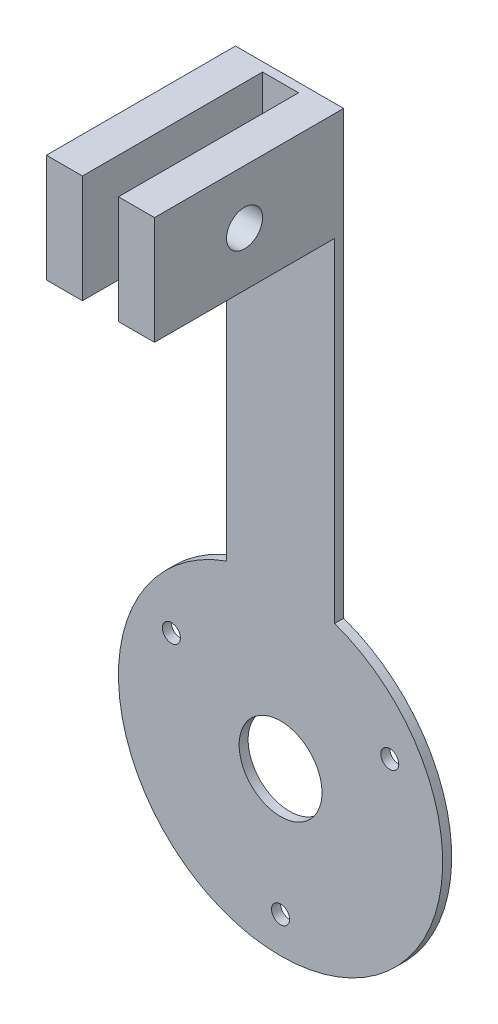
ISO-10303-21;
HEADER;
FILE_DESCRIPTION(('STEP AP214'),'2;1');
FILE_NAME('part.step','',(''),(''),'','','');
FILE_SCHEMA(('AUTOMOTIVE_DESIGN { 1 0 10303 214 1 1 1 1 }'));
ENDSEC;
DATA;
#1=APPLICATION_CONTEXT('core data for automotive mechanical design processes');
#2=APPLICATION_PROTOCOL_DEFINITION('international standard','automotive_design',2000,#1);
#3=PRODUCT_CONTEXT('',#1,'mechanical');
#4=PRODUCT('Part','Part','',(#3));
#5=PRODUCT_RELATED_PRODUCT_CATEGORY('part','',(#4));
#6=PRODUCT_DEFINITION_FORMATION('','',#4);
#7=PRODUCT_DEFINITION_CONTEXT('part definition',#1,'design');
#8=PRODUCT_DEFINITION('design','',#6,#7);
#9=PRODUCT_DEFINITION_SHAPE('','',#8);
#10=(LENGTH_UNIT() NAMED_UNIT(*) SI_UNIT(.MILLI.,.METRE.));
#11=(NAMED_UNIT(*) PLANE_ANGLE_UNIT() SI_UNIT($,.RADIAN.));
#12=(NAMED_UNIT(*) SI_UNIT($,.STERADIAN.) SOLID_ANGLE_UNIT());
#13=UNCERTAINTY_MEASURE_WITH_UNIT(LENGTH_MEASURE(1.E-05),#10,'distance_accuracy_value','');
#14=(GEOMETRIC_REPRESENTATION_CONTEXT(3) GLOBAL_UNCERTAINTY_ASSIGNED_CONTEXT((#13)) GLOBAL_UNIT_ASSIGNED_CONTEXT((#10,
#11,#12)) REPRESENTATION_CONTEXT('',''));
#15=CARTESIAN_POINT('',(0.,0.,0.));
#16=DIRECTION('',(0.,0.,1.));
#17=DIRECTION('',(1.,0.,0.));
#18=AXIS2_PLACEMENT_3D('',#15,#16,#17);
#19=CARTESIAN_POINT('',(0.,0.,3.175));
#20=DIRECTION('',(0.,0.,1.));
#21=DIRECTION('',(1.,0.,0.));
#22=AXIS2_PLACEMENT_3D('',#19,#20,#21);
#23=PLANE('',#22);
#24=CARTESIAN_POINT('',(0.,0.,3.175));
#25=DIRECTION('',(0.,0.,1.));
#26=DIRECTION('',(1.,0.,0.));
#27=AXIS2_PLACEMENT_3D('',#24,#25,#26);
#28=CIRCLE('',#27,57.15);
#29=CARTESIAN_POINT('',(-19.05,53.8815367264149,3.175));
#30=VERTEX_POINT('',#29);
#31=CARTESIAN_POINT('',(19.05,53.8815367264149,3.175));
#32=VERTEX_POINT('',#31);
#33=EDGE_CURVE('E132',#30,#32,#28,.T.);
#34=ORIENTED_EDGE('',*,*,#33,.T.);
#35=DIRECTION('',(0.,1.,0.));
#36=VECTOR('',#35,1.);
#37=CARTESIAN_POINT('',(19.05,0.,3.175));
#38=LINE('',#37,#36);
#39=CARTESIAN_POINT('',(19.05,171.45,3.175));
#40=VERTEX_POINT('',#39);
#41=EDGE_CURVE('E213',#32,#40,#38,.T.);
#42=ORIENTED_EDGE('',*,*,#41,.T.);
#43=DIRECTION('',(1.,0.,0.));
#44=VECTOR('',#43,1.);
#45=CARTESIAN_POINT('',(0.,171.45,3.175));
#46=LINE('',#45,#44);
#47=CARTESIAN_POINT('',(6.34999999999998,171.45,3.175));
#48=VERTEX_POINT('',#47);
#49=EDGE_CURVE('E156',#48,#40,#46,.T.);
#50=ORIENTED_EDGE('',*,*,#49,.F.);
#51=DIRECTION('',(0.,-1.,0.));
#52=VECTOR('',#51,1.);
#53=CARTESIAN_POINT('',(6.34999999999995,0.,3.175));
#54=LINE('',#53,#52);
#55=CARTESIAN_POINT('',(6.34999999999999,209.55,3.175));
#56=VERTEX_POINT('',#55);
#57=EDGE_CURVE('E151',#56,#48,#54,.T.);
#58=ORIENTED_EDGE('',*,*,#57,.F.);
#59=DIRECTION('',(1.,0.,0.));
#60=VECTOR('',#59,1.);
#61=CARTESIAN_POINT('',(0.,209.55,3.175));
#62=LINE('',#61,#60);
#63=CARTESIAN_POINT('',(-6.34999999999999,209.55,3.175));
#64=VERTEX_POINT('',#63);
#65=EDGE_CURVE('E52',#64,#56,#62,.T.);
#66=ORIENTED_EDGE('',*,*,#65,.F.);
#67=DIRECTION('',(0.,-1.,0.));
#68=VECTOR('',#67,1.);
#69=CARTESIAN_POINT('',(-6.34999999999995,0.,3.175));
#70=LINE('',#69,#68);
#71=CARTESIAN_POINT('',(-6.34999999999998,171.45,3.175));
#72=VERTEX_POINT('',#71);
#73=EDGE_CURVE('E173',#64,#72,#70,.T.);
#74=ORIENTED_EDGE('',*,*,#73,.T.);
#75=DIRECTION('',(1.,0.,0.));
#76=VECTOR('',#75,1.);
#77=CARTESIAN_POINT('',(0.,171.45,3.175));
#78=LINE('',#77,#76);
#79=CARTESIAN_POINT('',(-19.05,171.45,3.175));
#80=VERTEX_POINT('',#79);
#81=EDGE_CURVE('E58',#80,#72,#78,.T.);
#82=ORIENTED_EDGE('',*,*,#81,.F.);
#83=DIRECTION('',(0.,1.,0.));
#84=VECTOR('',#83,1.);
#85=CARTESIAN_POINT('',(-19.05,0.,3.175));
#86=LINE('',#85,#84);
#87=EDGE_CURVE('E211',#30,#80,#86,.T.);
#88=ORIENTED_EDGE('',*,*,#87,.F.);
#89=EDGE_LOOP('',(#34,#42,#50,#58,#66,#74,#82,#88));
#90=FACE_BOUND('',#89,.T.);
#91=CARTESIAN_POINT('',(-38.4948291982183,22.225,3.175));
#92=DIRECTION('',(0.,0.,1.));
#93=DIRECTION('',(1.,0.,0.));
#94=AXIS2_PLACEMENT_3D('',#91,#92,#93);
#95=CIRCLE('',#94,3.175);
#96=CARTESIAN_POINT('',(-35.3198291982183,22.225,3.175));
#97=VERTEX_POINT('',#96);
#98=EDGE_CURVE('E197',#97,#97,#95,.T.);
#99=ORIENTED_EDGE('',*,*,#98,.F.);
#100=EDGE_LOOP('',(#99));
#101=FACE_BOUND('',#100,.T.);
#102=CARTESIAN_POINT('',(38.4948291982183,22.225,3.175));
#103=DIRECTION('',(0.,0.,1.));
#104=DIRECTION('',(1.,0.,0.));
#105=AXIS2_PLACEMENT_3D('',#102,#103,#104);
#106=CIRCLE('',#105,3.175);
#107=CARTESIAN_POINT('',(41.6698291982183,22.225,3.175));
#108=VERTEX_POINT('',#107);
#109=EDGE_CURVE('E203',#108,#108,#106,.T.);
#110=ORIENTED_EDGE('',*,*,#109,.F.);
#111=EDGE_LOOP('',(#110));
#112=FACE_BOUND('',#111,.T.);
#113=CARTESIAN_POINT('',(0.,-44.45,3.175));
#114=DIRECTION('',(0.,0.,1.));
#115=DIRECTION('',(1.,0.,0.));
#116=AXIS2_PLACEMENT_3D('',#113,#114,#115);
#117=CIRCLE('',#116,3.175);
#118=CARTESIAN_POINT('',(3.175,-44.45,3.175));
#119=VERTEX_POINT('',#118);
#120=EDGE_CURVE('E194',#119,#119,#117,.T.);
#121=ORIENTED_EDGE('',*,*,#120,.F.);
#122=EDGE_LOOP('',(#121));
#123=FACE_BOUND('',#122,.T.);
#124=CARTESIAN_POINT('',(0.,0.,3.175));
#125=DIRECTION('',(0.,0.,1.));
#126=DIRECTION('',(1.,0.,0.));
#127=AXIS2_PLACEMENT_3D('',#124,#125,#126);
#128=CIRCLE('',#127,14.605);
#129=CARTESIAN_POINT('',(14.605,0.,3.175));
#130=VERTEX_POINT('',#129);
#131=EDGE_CURVE('E218',#130,#130,#128,.T.);
#132=ORIENTED_EDGE('',*,*,#131,.F.);
#133=EDGE_LOOP('',(#132));
#134=FACE_BOUND('',#133,.T.);
#135=ADVANCED_FACE('F36',(#90,#101,#112,#123,#134),#23,.T.);
#136=CARTESIAN_POINT('',(-19.05,0.,3.175));
#137=DIRECTION('',(-1.,0.,0.));
#138=DIRECTION('',(0.,0.,1.));
#139=AXIS2_PLACEMENT_3D('',#136,#137,#138);
#140=PLANE('',#139);
#141=CARTESIAN_POINT('',(-19.05,190.5,34.925));
#142=DIRECTION('',(-1.,0.,0.));
#143=DIRECTION('',(0.,0.,1.));
#144=AXIS2_PLACEMENT_3D('',#141,#142,#143);
#145=CIRCLE('',#144,6.35);
#146=CARTESIAN_POINT('',(-19.05,190.5,41.275));
#147=VERTEX_POINT('',#146);
#148=EDGE_CURVE('E141',#147,#147,#145,.T.);
#149=ORIENTED_EDGE('',*,*,#148,.F.);
#150=EDGE_LOOP('',(#149));
#151=FACE_BOUND('',#150,.T.);
#152=DIRECTION('',(0.,1.,0.));
#153=VECTOR('',#152,1.);
#154=CARTESIAN_POINT('',(-19.05,0.,0.));
#155=LINE('',#154,#153);
#156=CARTESIAN_POINT('',(-19.05,53.8815367264149,0.));
#157=VERTEX_POINT('',#156);
#158=CARTESIAN_POINT('',(-19.05,209.55,0.));
#159=VERTEX_POINT('',#158);
#160=EDGE_CURVE('E113',#157,#159,#155,.T.);
#161=ORIENTED_EDGE('',*,*,#160,.F.);
#162=DIRECTION('',(0.,0.,1.));
#163=VECTOR('',#162,1.);
#164=CARTESIAN_POINT('',(-19.05,53.8815367264149,0.));
#165=LINE('',#164,#163);
#166=EDGE_CURVE('E115',#157,#30,#165,.T.);
#167=ORIENTED_EDGE('',*,*,#166,.T.);
#168=ORIENTED_EDGE('',*,*,#87,.T.);
#169=DIRECTION('',(0.,0.,-1.));
#170=VECTOR('',#169,1.);
#171=CARTESIAN_POINT('',(-19.05,171.45,66.675));
#172=LINE('',#171,#170);
#173=CARTESIAN_POINT('',(-19.05,171.45,66.675));
#174=VERTEX_POINT('',#173);
#175=EDGE_CURVE('E189',#174,#80,#172,.T.);
#176=ORIENTED_EDGE('',*,*,#175,.F.);
#177=DIRECTION('',(0.,-1.,0.));
#178=VECTOR('',#177,1.);
#179=CARTESIAN_POINT('',(-19.05,0.,66.675));
#180=LINE('',#179,#178);
#181=CARTESIAN_POINT('',(-19.05,209.55,66.675));
#182=VERTEX_POINT('',#181);
#183=EDGE_CURVE('E180',#182,#174,#180,.T.);
#184=ORIENTED_EDGE('',*,*,#183,.F.);
#185=DIRECTION('',(0.,0.,-1.));
#186=VECTOR('',#185,1.);
#187=CARTESIAN_POINT('',(-19.05,209.55,3.175));
#188=LINE('',#187,#186);
#189=EDGE_CURVE('E45',#182,#159,#188,.T.);
#190=ORIENTED_EDGE('',*,*,#189,.T.);
#191=EDGE_LOOP('',(#161,#167,#168,#176,#184,#190));
#192=FACE_BOUND('',#191,.T.);
#193=ADVANCED_FACE('F38',(#151,#192),#140,.T.);
#194=CARTESIAN_POINT('',(19.05,0.,3.175));
#195=DIRECTION('',(-1.,0.,0.));
#196=DIRECTION('',(0.,0.,1.));
#197=AXIS2_PLACEMENT_3D('',#194,#195,#196);
#198=PLANE('',#197);
#199=CARTESIAN_POINT('',(19.05,190.5,34.925));
#200=DIRECTION('',(-1.,0.,0.));
#201=DIRECTION('',(0.,0.,1.));
#202=AXIS2_PLACEMENT_3D('',#199,#200,#201);
#203=CIRCLE('',#202,6.35);
#204=CARTESIAN_POINT('',(19.05,190.5,41.275));
#205=VERTEX_POINT('',#204);
#206=EDGE_CURVE('E148',#205,#205,#203,.T.);
#207=ORIENTED_EDGE('',*,*,#206,.T.);
#208=EDGE_LOOP('',(#207));
#209=FACE_BOUND('',#208,.T.);
#210=DIRECTION('',(0.,1.,0.));
#211=VECTOR('',#210,1.);
#212=CARTESIAN_POINT('',(19.05,0.,0.));
#213=LINE('',#212,#211);
#214=CARTESIAN_POINT('',(19.05,53.8815367264149,0.));
#215=VERTEX_POINT('',#214);
#216=CARTESIAN_POINT('',(19.05,209.55,0.));
#217=VERTEX_POINT('',#216);
#218=EDGE_CURVE('E122',#215,#217,#213,.T.);
#219=ORIENTED_EDGE('',*,*,#218,.T.);
#220=DIRECTION('',(0.,0.,-1.));
#221=VECTOR('',#220,1.);
#222=CARTESIAN_POINT('',(19.05,209.55,3.175));
#223=LINE('',#222,#221);
#224=CARTESIAN_POINT('',(19.05,209.55,66.675));
#225=VERTEX_POINT('',#224);
#226=EDGE_CURVE('E11',#225,#217,#223,.T.);
#227=ORIENTED_EDGE('',*,*,#226,.F.);
#228=DIRECTION('',(0.,1.,0.));
#229=VECTOR('',#228,1.);
#230=CARTESIAN_POINT('',(19.05,0.,66.675));
#231=LINE('',#230,#229);
#232=CARTESIAN_POINT('',(19.05,171.45,66.675));
#233=VERTEX_POINT('',#232);
#234=EDGE_CURVE('E158',#233,#225,#231,.T.);
#235=ORIENTED_EDGE('',*,*,#234,.F.);
#236=DIRECTION('',(0.,0.,-1.));
#237=VECTOR('',#236,1.);
#238=CARTESIAN_POINT('',(19.05,171.45,66.675));
#239=LINE('',#238,#237);
#240=EDGE_CURVE('E168',#233,#40,#239,.T.);
#241=ORIENTED_EDGE('',*,*,#240,.T.);
#242=ORIENTED_EDGE('',*,*,#41,.F.);
#243=DIRECTION('',(0.,0.,1.));
#244=VECTOR('',#243,1.);
#245=CARTESIAN_POINT('',(19.05,53.8815367264149,0.));
#246=LINE('',#245,#244);
#247=EDGE_CURVE('E133',#215,#32,#246,.T.);
#248=ORIENTED_EDGE('',*,*,#247,.F.);
#249=EDGE_LOOP('',(#219,#227,#235,#241,#242,#248));
#250=FACE_BOUND('',#249,.T.);
#251=ADVANCED_FACE('F240',(#209,#250),#198,.F.);
#252=CARTESIAN_POINT('',(0.,209.55,3.175));
#253=DIRECTION('',(0.,1.,0.));
#254=DIRECTION('',(0.,0.,1.));
#255=AXIS2_PLACEMENT_3D('',#252,#253,#254);
#256=PLANE('',#255);
#257=DIRECTION('',(1.,0.,0.));
#258=VECTOR('',#257,1.);
#259=CARTESIAN_POINT('',(0.,209.55,0.));
#260=LINE('',#259,#258);
#261=EDGE_CURVE('E222',#159,#217,#260,.T.);
#262=ORIENTED_EDGE('',*,*,#261,.F.);
#263=ORIENTED_EDGE('',*,*,#189,.F.);
#264=DIRECTION('',(-1.,0.,0.));
#265=VECTOR('',#264,1.);
#266=CARTESIAN_POINT('',(0.,209.55,66.675));
#267=LINE('',#266,#265);
#268=CARTESIAN_POINT('',(-6.34999999999999,209.55,66.675));
#269=VERTEX_POINT('',#268);
#270=EDGE_CURVE('E177',#269,#182,#267,.T.);
#271=ORIENTED_EDGE('',*,*,#270,.F.);
#272=DIRECTION('',(0.,0.,-1.));
#273=VECTOR('',#272,1.);
#274=CARTESIAN_POINT('',(-6.34999999999999,209.55,66.675));
#275=LINE('',#274,#273);
#276=EDGE_CURVE('E192',#269,#64,#275,.T.);
#277=ORIENTED_EDGE('',*,*,#276,.T.);
#278=ORIENTED_EDGE('',*,*,#65,.T.);
#279=DIRECTION('',(0.,0.,-1.));
#280=VECTOR('',#279,1.);
#281=CARTESIAN_POINT('',(6.34999999999999,209.55,66.675));
#282=LINE('',#281,#280);
#283=CARTESIAN_POINT('',(6.34999999999999,209.55,66.675));
#284=VERTEX_POINT('',#283);
#285=EDGE_CURVE('E163',#284,#56,#282,.T.);
#286=ORIENTED_EDGE('',*,*,#285,.F.);
#287=DIRECTION('',(-1.,0.,0.));
#288=VECTOR('',#287,1.);
#289=CARTESIAN_POINT('',(0.,209.55,66.675));
#290=LINE('',#289,#288);
#291=EDGE_CURVE('E161',#225,#284,#290,.T.);
#292=ORIENTED_EDGE('',*,*,#291,.F.);
#293=ORIENTED_EDGE('',*,*,#226,.T.);
#294=EDGE_LOOP('',(#262,#263,#271,#277,#278,#286,#292,#293));
#295=FACE_BOUND('',#294,.T.);
#296=ADVANCED_FACE('F230',(#295),#256,.T.);
#297=CARTESIAN_POINT('',(0.,0.,3.175));
#298=DIRECTION('',(0.,0.,-1.));
#299=DIRECTION('',(-1.,0.,0.));
#300=AXIS2_PLACEMENT_3D('',#297,#298,#299);
#301=CYLINDRICAL_SURFACE('',#300,14.605);
#302=ORIENTED_EDGE('',*,*,#131,.T.);
#303=EDGE_LOOP('',(#302));
#304=FACE_BOUND('',#303,.T.);
#305=CARTESIAN_POINT('',(0.,0.,0.));
#306=DIRECTION('',(0.,0.,1.));
#307=DIRECTION('',(1.,0.,0.));
#308=AXIS2_PLACEMENT_3D('',#305,#306,#307);
#309=CIRCLE('',#308,14.605);
#310=CARTESIAN_POINT('',(14.605,0.,0.));
#311=VERTEX_POINT('',#310);
#312=EDGE_CURVE('E214',#311,#311,#309,.T.);
#313=ORIENTED_EDGE('',*,*,#312,.F.);
#314=EDGE_LOOP('',(#313));
#315=FACE_BOUND('',#314,.T.);
#316=ADVANCED_FACE('F228',(#304,#315),#301,.F.);
#317=CARTESIAN_POINT('',(0.,0.,0.));
#318=DIRECTION('',(0.,0.,1.));
#319=DIRECTION('',(1.,0.,0.));
#320=AXIS2_PLACEMENT_3D('',#317,#318,#319);
#321=PLANE('',#320);
#322=CARTESIAN_POINT('',(-38.4948291982183,22.225,0.));
#323=DIRECTION('',(0.,0.,1.));
#324=DIRECTION('',(1.,0.,0.));
#325=AXIS2_PLACEMENT_3D('',#322,#323,#324);
#326=CIRCLE('',#325,3.175);
#327=CARTESIAN_POINT('',(-35.3198291982183,22.225,0.));
#328=VERTEX_POINT('',#327);
#329=EDGE_CURVE('E123',#328,#328,#326,.T.);
#330=ORIENTED_EDGE('',*,*,#329,.T.);
#331=EDGE_LOOP('',(#330));
#332=FACE_BOUND('',#331,.T.);
#333=CARTESIAN_POINT('',(38.4948291982183,22.225,0.));
#334=DIRECTION('',(0.,0.,1.));
#335=DIRECTION('',(1.,0.,0.));
#336=AXIS2_PLACEMENT_3D('',#333,#334,#335);
#337=CIRCLE('',#336,3.175);
#338=CARTESIAN_POINT('',(41.6698291982183,22.225,0.));
#339=VERTEX_POINT('',#338);
#340=EDGE_CURVE('E200',#339,#339,#337,.T.);
#341=ORIENTED_EDGE('',*,*,#340,.T.);
#342=EDGE_LOOP('',(#341));
#343=FACE_BOUND('',#342,.T.);
#344=CARTESIAN_POINT('',(0.,-44.45,0.));
#345=DIRECTION('',(0.,0.,1.));
#346=DIRECTION('',(1.,0.,0.));
#347=AXIS2_PLACEMENT_3D('',#344,#345,#346);
#348=CIRCLE('',#347,3.175);
#349=CARTESIAN_POINT('',(3.175,-44.45,0.));
#350=VERTEX_POINT('',#349);
#351=EDGE_CURVE('E206',#350,#350,#348,.T.);
#352=ORIENTED_EDGE('',*,*,#351,.T.);
#353=EDGE_LOOP('',(#352));
#354=FACE_BOUND('',#353,.T.);
#355=ORIENTED_EDGE('',*,*,#218,.F.);
#356=CARTESIAN_POINT('',(0.,0.,0.));
#357=DIRECTION('',(0.,0.,1.));
#358=DIRECTION('',(1.,0.,0.));
#359=AXIS2_PLACEMENT_3D('',#356,#357,#358);
#360=CIRCLE('',#359,57.15);
#361=EDGE_CURVE('E129',#157,#215,#360,.T.);
#362=ORIENTED_EDGE('',*,*,#361,.F.);
#363=ORIENTED_EDGE('',*,*,#160,.T.);
#364=ORIENTED_EDGE('',*,*,#261,.T.);
#365=EDGE_LOOP('',(#355,#362,#363,#364));
#366=FACE_BOUND('',#365,.T.);
#367=ORIENTED_EDGE('',*,*,#312,.T.);
#368=EDGE_LOOP('',(#367));
#369=FACE_BOUND('',#368,.T.);
#370=ADVANCED_FACE('F135',(#332,#343,#354,#366,#369),#321,.F.);
#371=CARTESIAN_POINT('',(0.,-44.45,0.));
#372=DIRECTION('',(0.,0.,1.));
#373=DIRECTION('',(1.,0.,0.));
#374=AXIS2_PLACEMENT_3D('',#371,#372,#373);
#375=CYLINDRICAL_SURFACE('',#374,3.175);
#376=ORIENTED_EDGE('',*,*,#351,.F.);
#377=EDGE_LOOP('',(#376));
#378=FACE_BOUND('',#377,.T.);
#379=ORIENTED_EDGE('',*,*,#120,.T.);
#380=EDGE_LOOP('',(#379));
#381=FACE_BOUND('',#380,.T.);
#382=ADVANCED_FACE('F237',(#378,#381),#375,.F.);
#383=CARTESIAN_POINT('',(38.4948291982183,22.225,0.));
#384=DIRECTION('',(0.,0.,1.));
#385=DIRECTION('',(1.,0.,0.));
#386=AXIS2_PLACEMENT_3D('',#383,#384,#385);
#387=CYLINDRICAL_SURFACE('',#386,3.175);
#388=ORIENTED_EDGE('',*,*,#340,.F.);
#389=EDGE_LOOP('',(#388));
#390=FACE_BOUND('',#389,.T.);
#391=ORIENTED_EDGE('',*,*,#109,.T.);
#392=EDGE_LOOP('',(#391));
#393=FACE_BOUND('',#392,.T.);
#394=ADVANCED_FACE('F253',(#390,#393),#387,.F.);
#395=CARTESIAN_POINT('',(-38.4948291982183,22.225,0.));
#396=DIRECTION('',(0.,0.,1.));
#397=DIRECTION('',(1.,0.,0.));
#398=AXIS2_PLACEMENT_3D('',#395,#396,#397);
#399=CYLINDRICAL_SURFACE('',#398,3.175);
#400=ORIENTED_EDGE('',*,*,#329,.F.);
#401=EDGE_LOOP('',(#400));
#402=FACE_BOUND('',#401,.T.);
#403=ORIENTED_EDGE('',*,*,#98,.T.);
#404=EDGE_LOOP('',(#403));
#405=FACE_BOUND('',#404,.T.);
#406=ADVANCED_FACE('F257',(#402,#405),#399,.F.);
#407=CARTESIAN_POINT('',(-6.34999999999995,0.,66.675));
#408=DIRECTION('',(1.,0.,0.));
#409=DIRECTION('',(0.,1.,0.));
#410=AXIS2_PLACEMENT_3D('',#407,#408,#409);
#411=PLANE('',#410);
#412=CARTESIAN_POINT('',(-6.34999999999998,190.5,34.925));
#413=DIRECTION('',(1.,0.,0.));
#414=DIRECTION('',(0.,1.,0.));
#415=AXIS2_PLACEMENT_3D('',#412,#413,#414);
#416=CIRCLE('',#415,6.35);
#417=CARTESIAN_POINT('',(-6.34999999999998,196.85,34.925));
#418=VERTEX_POINT('',#417);
#419=EDGE_CURVE('E145',#418,#418,#416,.T.);
#420=ORIENTED_EDGE('',*,*,#419,.F.);
#421=EDGE_LOOP('',(#420));
#422=FACE_BOUND('',#421,.T.);
#423=ORIENTED_EDGE('',*,*,#73,.F.);
#424=ORIENTED_EDGE('',*,*,#276,.F.);
#425=DIRECTION('',(0.,-1.,0.));
#426=VECTOR('',#425,1.);
#427=CARTESIAN_POINT('',(-6.34999999999995,0.,66.675));
#428=LINE('',#427,#426);
#429=CARTESIAN_POINT('',(-6.34999999999998,171.45,66.675));
#430=VERTEX_POINT('',#429);
#431=EDGE_CURVE('E174',#269,#430,#428,.T.);
#432=ORIENTED_EDGE('',*,*,#431,.T.);
#433=DIRECTION('',(0.,0.,-1.));
#434=VECTOR('',#433,1.);
#435=CARTESIAN_POINT('',(-6.34999999999998,171.45,66.675));
#436=LINE('',#435,#434);
#437=EDGE_CURVE('E184',#430,#72,#436,.T.);
#438=ORIENTED_EDGE('',*,*,#437,.T.);
#439=EDGE_LOOP('',(#423,#424,#432,#438));
#440=FACE_BOUND('',#439,.T.);
#441=ADVANCED_FACE('F261',(#422,#440),#411,.T.);
#442=CARTESIAN_POINT('',(0.,171.45,66.675));
#443=DIRECTION('',(0.,1.,0.));
#444=DIRECTION('',(0.,0.,1.));
#445=AXIS2_PLACEMENT_3D('',#442,#443,#444);
#446=PLANE('',#445);
#447=ORIENTED_EDGE('',*,*,#81,.T.);
#448=ORIENTED_EDGE('',*,*,#437,.F.);
#449=DIRECTION('',(1.,0.,0.));
#450=VECTOR('',#449,1.);
#451=CARTESIAN_POINT('',(0.,171.45,66.675));
#452=LINE('',#451,#450);
#453=EDGE_CURVE('E182',#174,#430,#452,.T.);
#454=ORIENTED_EDGE('',*,*,#453,.F.);
#455=ORIENTED_EDGE('',*,*,#175,.T.);
#456=EDGE_LOOP('',(#447,#448,#454,#455));
#457=FACE_BOUND('',#456,.T.);
#458=ADVANCED_FACE('F265',(#457),#446,.F.);
#459=CARTESIAN_POINT('',(0.,0.,66.675));
#460=DIRECTION('',(0.,0.,1.));
#461=DIRECTION('',(1.,0.,0.));
#462=AXIS2_PLACEMENT_3D('',#459,#460,#461);
#463=PLANE('',#462);
#464=ORIENTED_EDGE('',*,*,#431,.F.);
#465=ORIENTED_EDGE('',*,*,#270,.T.);
#466=ORIENTED_EDGE('',*,*,#183,.T.);
#467=ORIENTED_EDGE('',*,*,#453,.T.);
#468=EDGE_LOOP('',(#464,#465,#466,#467));
#469=FACE_BOUND('',#468,.T.);
#470=ADVANCED_FACE('F269',(#469),#463,.T.);
#471=CARTESIAN_POINT('',(6.34999999999995,0.,66.675));
#472=DIRECTION('',(1.,0.,0.));
#473=DIRECTION('',(0.,1.,0.));
#474=AXIS2_PLACEMENT_3D('',#471,#472,#473);
#475=PLANE('',#474);
#476=CARTESIAN_POINT('',(6.34999999999998,190.5,34.925));
#477=DIRECTION('',(1.,0.,0.));
#478=DIRECTION('',(0.,1.,0.));
#479=AXIS2_PLACEMENT_3D('',#476,#477,#478);
#480=CIRCLE('',#479,6.35);
#481=CARTESIAN_POINT('',(6.34999999999998,196.85,34.925));
#482=VERTEX_POINT('',#481);
#483=EDGE_CURVE('E40',#482,#482,#480,.T.);
#484=ORIENTED_EDGE('',*,*,#483,.T.);
#485=EDGE_LOOP('',(#484));
#486=FACE_BOUND('',#485,.T.);
#487=ORIENTED_EDGE('',*,*,#57,.T.);
#488=DIRECTION('',(0.,0.,-1.));
#489=VECTOR('',#488,1.);
#490=CARTESIAN_POINT('',(6.34999999999998,171.45,66.675));
#491=LINE('',#490,#489);
#492=CARTESIAN_POINT('',(6.34999999999998,171.45,66.675));
#493=VERTEX_POINT('',#492);
#494=EDGE_CURVE('E171',#493,#48,#491,.T.);
#495=ORIENTED_EDGE('',*,*,#494,.F.);
#496=DIRECTION('',(0.,-1.,0.));
#497=VECTOR('',#496,1.);
#498=CARTESIAN_POINT('',(6.34999999999995,0.,66.675));
#499=LINE('',#498,#497);
#500=EDGE_CURVE('E152',#284,#493,#499,.T.);
#501=ORIENTED_EDGE('',*,*,#500,.F.);
#502=ORIENTED_EDGE('',*,*,#285,.T.);
#503=EDGE_LOOP('',(#487,#495,#501,#502));
#504=FACE_BOUND('',#503,.T.);
#505=ADVANCED_FACE('F273',(#486,#504),#475,.F.);
#506=CARTESIAN_POINT('',(0.,171.45,66.675));
#507=DIRECTION('',(0.,1.,0.));
#508=DIRECTION('',(0.,0.,1.));
#509=AXIS2_PLACEMENT_3D('',#506,#507,#508);
#510=PLANE('',#509);
#511=ORIENTED_EDGE('',*,*,#49,.T.);
#512=ORIENTED_EDGE('',*,*,#240,.F.);
#513=DIRECTION('',(1.,0.,0.));
#514=VECTOR('',#513,1.);
#515=CARTESIAN_POINT('',(0.,171.45,66.675));
#516=LINE('',#515,#514);
#517=EDGE_CURVE('E155',#493,#233,#516,.T.);
#518=ORIENTED_EDGE('',*,*,#517,.F.);
#519=ORIENTED_EDGE('',*,*,#494,.T.);
#520=EDGE_LOOP('',(#511,#512,#518,#519));
#521=FACE_BOUND('',#520,.T.);
#522=ADVANCED_FACE('F277',(#521),#510,.F.);
#523=CARTESIAN_POINT('',(0.,0.,66.675));
#524=DIRECTION('',(0.,0.,1.));
#525=DIRECTION('',(1.,0.,0.));
#526=AXIS2_PLACEMENT_3D('',#523,#524,#525);
#527=PLANE('',#526);
#528=ORIENTED_EDGE('',*,*,#500,.T.);
#529=ORIENTED_EDGE('',*,*,#517,.T.);
#530=ORIENTED_EDGE('',*,*,#234,.T.);
#531=ORIENTED_EDGE('',*,*,#291,.T.);
#532=EDGE_LOOP('',(#528,#529,#530,#531));
#533=FACE_BOUND('',#532,.T.);
#534=ADVANCED_FACE('F281',(#533),#527,.T.);
#535=CARTESIAN_POINT('',(88.9,190.5,34.925));
#536=DIRECTION('',(-1.,0.,0.));
#537=DIRECTION('',(0.,0.,1.));
#538=AXIS2_PLACEMENT_3D('',#535,#536,#537);
#539=CYLINDRICAL_SURFACE('',#538,6.35);
#540=ORIENTED_EDGE('',*,*,#483,.F.);
#541=EDGE_LOOP('',(#540));
#542=FACE_BOUND('',#541,.T.);
#543=ORIENTED_EDGE('',*,*,#206,.F.);
#544=EDGE_LOOP('',(#543));
#545=FACE_BOUND('',#544,.T.);
#546=ADVANCED_FACE('F285',(#542,#545),#539,.F.);
#547=ORIENTED_EDGE('',*,*,#419,.T.);
#548=EDGE_LOOP('',(#547));
#549=FACE_BOUND('',#548,.T.);
#550=ORIENTED_EDGE('',*,*,#148,.T.);
#551=EDGE_LOOP('',(#550));
#552=FACE_BOUND('',#551,.T.);
#553=ADVANCED_FACE('F287',(#549,#552),#539,.F.);
#554=CARTESIAN_POINT('',(0.,0.,0.));
#555=DIRECTION('',(0.,0.,1.));
#556=DIRECTION('',(1.,0.,0.));
#557=AXIS2_PLACEMENT_3D('',#554,#555,#556);
#558=CYLINDRICAL_SURFACE('',#557,57.15);
#559=ORIENTED_EDGE('',*,*,#33,.F.);
#560=ORIENTED_EDGE('',*,*,#166,.F.);
#561=ORIENTED_EDGE('',*,*,#361,.T.);
#562=ORIENTED_EDGE('',*,*,#247,.T.);
#563=EDGE_LOOP('',(#559,#560,#561,#562));
#564=FACE_BOUND('',#563,.T.);
#565=ADVANCED_FACE('F127',(#564),#558,.T.);
#566=CLOSED_SHELL('',(#135,#193,#251,#296,#316,#370,#382,#394,#406,#441,#458,#470,#505,#522,
#534,#546,#553,#565));
#567=MANIFOLD_SOLID_BREP('B2',#566);
#568=ADVANCED_BREP_SHAPE_REPRESENTATION('',(#18,#567),#14);
#569=SHAPE_DEFINITION_REPRESENTATION(#9,#568);
ENDSEC;
END-ISO-10303-21;
